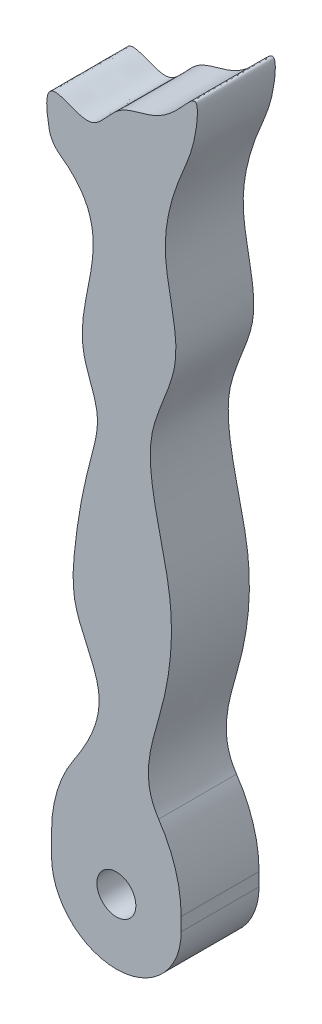
ISO-10303-21;
HEADER;
FILE_DESCRIPTION(('STEP AP214'),'2;1');
FILE_NAME('part.step','',(''),(''),'','','');
FILE_SCHEMA(('AUTOMOTIVE_DESIGN { 1 0 10303 214 1 1 1 1 }'));
ENDSEC;
DATA;
#1=APPLICATION_CONTEXT('core data for automotive mechanical design processes');
#2=APPLICATION_PROTOCOL_DEFINITION('international standard','automotive_design',2000,#1);
#3=PRODUCT_CONTEXT('',#1,'mechanical');
#4=PRODUCT('Part','Part','',(#3));
#5=PRODUCT_RELATED_PRODUCT_CATEGORY('part','',(#4));
#6=PRODUCT_DEFINITION_FORMATION('','',#4);
#7=PRODUCT_DEFINITION_CONTEXT('part definition',#1,'design');
#8=PRODUCT_DEFINITION('design','',#6,#7);
#9=PRODUCT_DEFINITION_SHAPE('','',#8);
#10=(LENGTH_UNIT() NAMED_UNIT(*) SI_UNIT(.MILLI.,.METRE.));
#11=(NAMED_UNIT(*) PLANE_ANGLE_UNIT() SI_UNIT($,.RADIAN.));
#12=(NAMED_UNIT(*) SI_UNIT($,.STERADIAN.) SOLID_ANGLE_UNIT());
#13=UNCERTAINTY_MEASURE_WITH_UNIT(LENGTH_MEASURE(1.E-05),#10,'distance_accuracy_value','');
#14=(GEOMETRIC_REPRESENTATION_CONTEXT(3) GLOBAL_UNCERTAINTY_ASSIGNED_CONTEXT((#13)) GLOBAL_UNIT_ASSIGNED_CONTEXT((#10,
#11,#12)) REPRESENTATION_CONTEXT('',''));
#15=CARTESIAN_POINT('',(0.,0.,0.));
#16=DIRECTION('',(0.,0.,1.));
#17=DIRECTION('',(1.,0.,0.));
#18=AXIS2_PLACEMENT_3D('',#15,#16,#17);
#19=CARTESIAN_POINT('',(0.,0.,6.));
#20=DIRECTION('',(0.,0.,1.));
#21=DIRECTION('',(1.,0.,0.));
#22=AXIS2_PLACEMENT_3D('',#19,#20,#21);
#23=PLANE('',#22);
#24=CARTESIAN_POINT('',(4.99,-4.99,6.));
#25=DIRECTION('',(0.,0.,1.));
#26=DIRECTION('',(1.,0.,0.));
#27=AXIS2_PLACEMENT_3D('',#24,#25,#26);
#28=CIRCLE('',#27,1.5);
#29=CARTESIAN_POINT('',(6.49,-4.99,6.));
#30=VERTEX_POINT('',#29);
#31=EDGE_CURVE('E144',#30,#30,#28,.T.);
#32=ORIENTED_EDGE('',*,*,#31,.F.);
#33=EDGE_LOOP('',(#32));
#34=FACE_BOUND('',#33,.T.);
#35=CARTESIAN_POINT('',(4.99,-4.99,6.));
#36=DIRECTION('',(0.,0.,1.));
#37=DIRECTION('',(1.,0.,0.));
#38=AXIS2_PLACEMENT_3D('',#35,#36,#37);
#39=CIRCLE('',#38,4.99);
#40=CARTESIAN_POINT('',(0.,-4.99,6.));
#41=VERTEX_POINT('',#40);
#42=CARTESIAN_POINT('',(9.98,-4.99,6.));
#43=VERTEX_POINT('',#42);
#44=EDGE_CURVE('E124',#41,#43,#39,.T.);
#45=ORIENTED_EDGE('',*,*,#44,.T.);
#46=DIRECTION('',(0.,-1.,0.));
#47=VECTOR('',#46,1.);
#48=CARTESIAN_POINT('',(9.98,0.,6.));
#49=LINE('',#48,#47);
#50=CARTESIAN_POINT('',(9.98,-3.97027980435303,6.));
#51=VERTEX_POINT('',#50);
#52=EDGE_CURVE('E128',#51,#43,#49,.T.);
#53=ORIENTED_EDGE('',*,*,#52,.F.);
#54=CARTESIAN_POINT('',(-0.0200000000000027,-3.97027980435303,6.));
#55=DIRECTION('',(0.,0.,1.));
#56=DIRECTION('',(1.,0.,0.));
#57=AXIS2_PLACEMENT_3D('',#54,#55,#56);
#58=CIRCLE('',#57,10.);
#59=CARTESIAN_POINT('',(8.24567465284087,1.65809674074271,6.));
#60=VERTEX_POINT('',#59);
#61=EDGE_CURVE('E230',#51,#60,#58,.T.);
#62=ORIENTED_EDGE('',*,*,#61,.T.);
#63=CARTESIAN_POINT('',(0.,42.5973535188665,6.));
#64=CARTESIAN_POINT('',(-1.37416776361586,48.5046458594314,6.));
#65=CARTESIAN_POINT('',(2.71808253226389,43.5726912842318,6.));
#66=CARTESIAN_POINT('',(4.82827520181116,47.7243203506309,6.));
#67=CARTESIAN_POINT('',(7.80778417163415,48.1508880987558,6.));
#68=CARTESIAN_POINT('',(9.4437713353899,49.2935827841813,6.));
#69=CARTESIAN_POINT('',(11.3623586634007,51.6284591964601,6.));
#70=CARTESIAN_POINT('',(11.1061791620638,47.8866974693389,6.));
#71=CARTESIAN_POINT('',(9.74359687436935,45.274160997908,6.));
#72=CARTESIAN_POINT('',(7.96002406904631,39.3631270866745,6.));
#73=CARTESIAN_POINT('',(10.7081509115366,33.0621930492346,6.));
#74=CARTESIAN_POINT('',(7.46997297742276,28.0469548101098,6.));
#75=CARTESIAN_POINT('',(7.68459606501081,22.5231191866999,6.));
#76=CARTESIAN_POINT('',(9.64502502926322,16.822172505094,6.));
#77=CARTESIAN_POINT('',(8.82164780003494,8.44030856162568,6.));
#78=CARTESIAN_POINT('',(6.05361406318936,2.65302671895344,6.));
#79=CARTESIAN_POINT('',(9.98,0.,6.));
#80=B_SPLINE_CURVE_WITH_KNOTS('',3,(#63,#64,#65,#66,#67,#68,#69,#70,#71,#72,#73,#74,#75,#76,#77,
#78,#79),.UNSPECIFIED.,.F.,.F.,(4,1,1,1,1,1,1,1,1,1,1,1,1,1,4),(0.,0.0816935318952506,
0.122819376835554,0.160760334375449,0.205378373312999,0.226065166843685,0.252136568138596,
0.308777768516648,0.391029694958459,0.500424408974528,0.587678436213662,0.631958895610175,
0.740886228331794,0.850025520120339,1.),.UNSPECIFIED.);
#81=CARTESIAN_POINT('',(-0.180841435382461,43.4408167100634,6.));
#82=VERTEX_POINT('',#81);
#83=EDGE_CURVE('E143',#82,#60,#80,.T.);
#84=ORIENTED_EDGE('',*,*,#83,.F.);
#85=CARTESIAN_POINT('',(1.78281542140347,43.8203582081866,6.));
#86=DIRECTION('',(0.,0.,1.));
#87=DIRECTION('',(1.,0.,0.));
#88=AXIS2_PLACEMENT_3D('',#85,#86,#87);
#89=CIRCLE('',#88,2.);
#90=CARTESIAN_POINT('',(0.627189000372463,42.1880201381119,6.));
#91=VERTEX_POINT('',#90);
#92=EDGE_CURVE('E67',#82,#91,#89,.T.);
#93=ORIENTED_EDGE('',*,*,#92,.T.);
#94=CARTESIAN_POINT('',(0.,42.5973535188665,6.));
#95=CARTESIAN_POINT('',(5.99917514769112,38.9776444105918,6.));
#96=CARTESIAN_POINT('',(0.377371098702882,32.7881709273886,6.));
#97=CARTESIAN_POINT('',(3.99264049027616,26.3880237657193,6.));
#98=CARTESIAN_POINT('',(2.58365344448983,21.7908235944806,6.));
#99=CARTESIAN_POINT('',(1.79791630641771,17.4144245417566,6.));
#100=CARTESIAN_POINT('',(1.45259306535408,12.0937314718818,6.));
#101=CARTESIAN_POINT('',(5.42598360781251,6.83613272854859,6.));
#102=CARTESIAN_POINT('',(1.50971209153614,2.01793829065264,6.));
#103=CARTESIAN_POINT('',(0.,0.,6.));
#104=B_SPLINE_CURVE_WITH_KNOTS('',3,(#94,#95,#96,#97,#98,#99,#100,#101,#102,#103),.UNSPECIFIED.,
.F.,.F.,(4,1,1,1,1,1,1,4),(0.,0.301224544779534,0.380755767888701,0.457986823242878,
0.608527536498481,0.686337501052727,0.807000810670003,1.),.UNSPECIFIED.);
#105=CARTESIAN_POINT('',(1.71356480303645,2.3441957016098,6.));
#106=VERTEX_POINT('',#105);
#107=EDGE_CURVE('E146',#91,#106,#104,.T.);
#108=ORIENTED_EDGE('',*,*,#107,.T.);
#109=CARTESIAN_POINT('',(10.,-3.25357097149507,6.));
#110=DIRECTION('',(0.,0.,1.));
#111=DIRECTION('',(1.,0.,0.));
#112=AXIS2_PLACEMENT_3D('',#109,#110,#111);
#113=CIRCLE('',#112,10.);
#114=CARTESIAN_POINT('',(0.,-3.25357097149507,6.));
#115=VERTEX_POINT('',#114);
#116=EDGE_CURVE('E228',#106,#115,#113,.T.);
#117=ORIENTED_EDGE('',*,*,#116,.T.);
#118=DIRECTION('',(0.,-1.,0.));
#119=VECTOR('',#118,1.);
#120=CARTESIAN_POINT('',(0.,0.,6.));
#121=LINE('',#120,#119);
#122=EDGE_CURVE('E131',#115,#41,#121,.T.);
#123=ORIENTED_EDGE('',*,*,#122,.T.);
#124=EDGE_LOOP('',(#45,#53,#62,#84,#93,#108,#117,#123));
#125=FACE_BOUND('',#124,.T.);
#126=ADVANCED_FACE('F59',(#34,#125),#23,.T.);
#127=CARTESIAN_POINT('',(0.,0.,0.));
#128=DIRECTION('',(0.,0.,1.));
#129=DIRECTION('',(1.,0.,0.));
#130=AXIS2_PLACEMENT_3D('',#127,#128,#129);
#131=PLANE('',#130);
#132=CARTESIAN_POINT('',(4.99,-4.99,0.));
#133=DIRECTION('',(0.,0.,1.));
#134=DIRECTION('',(1.,0.,0.));
#135=AXIS2_PLACEMENT_3D('',#132,#133,#134);
#136=CIRCLE('',#135,1.5);
#137=CARTESIAN_POINT('',(6.49,-4.99,0.));
#138=VERTEX_POINT('',#137);
#139=EDGE_CURVE('E250',#138,#138,#136,.T.);
#140=ORIENTED_EDGE('',*,*,#139,.T.);
#141=EDGE_LOOP('',(#140));
#142=FACE_BOUND('',#141,.T.);
#143=DIRECTION('',(0.,-1.,0.));
#144=VECTOR('',#143,1.);
#145=CARTESIAN_POINT('',(9.98,0.,0.));
#146=LINE('',#145,#144);
#147=CARTESIAN_POINT('',(9.98,-3.97027980435303,0.));
#148=VERTEX_POINT('',#147);
#149=CARTESIAN_POINT('',(9.98,-4.99,0.));
#150=VERTEX_POINT('',#149);
#151=EDGE_CURVE('E249',#148,#150,#146,.T.);
#152=ORIENTED_EDGE('',*,*,#151,.T.);
#153=CARTESIAN_POINT('',(4.99,-4.99,0.));
#154=DIRECTION('',(0.,0.,1.));
#155=DIRECTION('',(1.,0.,0.));
#156=AXIS2_PLACEMENT_3D('',#153,#154,#155);
#157=CIRCLE('',#156,4.99);
#158=CARTESIAN_POINT('',(0.,-4.99,0.));
#159=VERTEX_POINT('',#158);
#160=EDGE_CURVE('E12',#159,#150,#157,.T.);
#161=ORIENTED_EDGE('',*,*,#160,.F.);
#162=DIRECTION('',(0.,-1.,0.));
#163=VECTOR('',#162,1.);
#164=CARTESIAN_POINT('',(0.,0.,0.));
#165=LINE('',#164,#163);
#166=CARTESIAN_POINT('',(0.,-3.25357097149507,0.));
#167=VERTEX_POINT('',#166);
#168=EDGE_CURVE('E149',#167,#159,#165,.T.);
#169=ORIENTED_EDGE('',*,*,#168,.F.);
#170=CARTESIAN_POINT('',(10.,-3.25357097149507,0.));
#171=DIRECTION('',(0.,0.,1.));
#172=DIRECTION('',(1.,0.,0.));
#173=AXIS2_PLACEMENT_3D('',#170,#171,#172);
#174=CIRCLE('',#173,10.);
#175=CARTESIAN_POINT('',(1.71356480303645,2.3441957016098,0.));
#176=VERTEX_POINT('',#175);
#177=EDGE_CURVE('E223',#167,#176,#174,.F.);
#178=ORIENTED_EDGE('',*,*,#177,.T.);
#179=CARTESIAN_POINT('',(0.,42.5973535188665,0.));
#180=CARTESIAN_POINT('',(5.99917514769112,38.9776444105918,0.));
#181=CARTESIAN_POINT('',(0.377371098702882,32.7881709273886,0.));
#182=CARTESIAN_POINT('',(3.99264049027616,26.3880237657193,0.));
#183=CARTESIAN_POINT('',(2.58365344448983,21.7908235944806,0.));
#184=CARTESIAN_POINT('',(1.79791630641771,17.4144245417566,0.));
#185=CARTESIAN_POINT('',(1.45259306535408,12.0937314718818,0.));
#186=CARTESIAN_POINT('',(5.42598360781251,6.83613272854859,0.));
#187=CARTESIAN_POINT('',(1.50971209153614,2.01793829065264,0.));
#188=CARTESIAN_POINT('',(0.,0.,0.));
#189=B_SPLINE_CURVE_WITH_KNOTS('',3,(#179,#180,#181,#182,#183,#184,#185,#186,#187,#188),
.UNSPECIFIED.,.F.,.F.,(4,1,1,1,1,1,1,4),(0.,0.301224544779534,0.380755767888701,
0.457986823242878,0.608527536498481,0.686337501052727,0.807000810670003,1.),.UNSPECIFIED.);
#190=CARTESIAN_POINT('',(0.627189000372475,42.1880201381119,0.));
#191=VERTEX_POINT('',#190);
#192=EDGE_CURVE('E212',#191,#176,#189,.T.);
#193=ORIENTED_EDGE('',*,*,#192,.F.);
#194=CARTESIAN_POINT('',(1.78281542140347,43.8203582081866,0.));
#195=DIRECTION('',(0.,0.,1.));
#196=DIRECTION('',(1.,0.,0.));
#197=AXIS2_PLACEMENT_3D('',#194,#195,#196);
#198=CIRCLE('',#197,2.);
#199=CARTESIAN_POINT('',(-0.180841435382461,43.4408167100634,0.));
#200=VERTEX_POINT('',#199);
#201=EDGE_CURVE('E239',#191,#200,#198,.F.);
#202=ORIENTED_EDGE('',*,*,#201,.T.);
#203=CARTESIAN_POINT('',(0.,42.5973535188665,0.));
#204=CARTESIAN_POINT('',(-1.37416776361586,48.5046458594314,0.));
#205=CARTESIAN_POINT('',(2.71808253226389,43.5726912842318,0.));
#206=CARTESIAN_POINT('',(4.82827520181116,47.7243203506309,0.));
#207=CARTESIAN_POINT('',(7.80778417163415,48.1508880987558,0.));
#208=CARTESIAN_POINT('',(9.4437713353899,49.2935827841813,0.));
#209=CARTESIAN_POINT('',(11.3623586634007,51.6284591964601,0.));
#210=CARTESIAN_POINT('',(11.1061791620638,47.8866974693389,0.));
#211=CARTESIAN_POINT('',(9.74359687436935,45.274160997908,0.));
#212=CARTESIAN_POINT('',(7.96002406904631,39.3631270866745,0.));
#213=CARTESIAN_POINT('',(10.7081509115366,33.0621930492346,0.));
#214=CARTESIAN_POINT('',(7.46997297742276,28.0469548101098,0.));
#215=CARTESIAN_POINT('',(7.68459606501081,22.5231191866999,0.));
#216=CARTESIAN_POINT('',(9.64502502926322,16.822172505094,0.));
#217=CARTESIAN_POINT('',(8.82164780003494,8.44030856162568,0.));
#218=CARTESIAN_POINT('',(6.05361406318936,2.65302671895344,0.));
#219=CARTESIAN_POINT('',(9.98,0.,0.));
#220=B_SPLINE_CURVE_WITH_KNOTS('',3,(#203,#204,#205,#206,#207,#208,#209,#210,#211,#212,#213,
#214,#215,#216,#217,#218,#219),.UNSPECIFIED.,.F.,.F.,(4,1,1,1,1,1,1,1,1,1,1,1,1,1,4),(0.,
0.0816935318952506,0.122819376835554,0.160760334375449,0.205378373312999,0.226065166843685,
0.252136568138596,0.308777768516648,0.391029694958459,0.500424408974528,0.587678436213662,
0.631958895610175,0.740886228331794,0.850025520120339,1.),.UNSPECIFIED.);
#221=CARTESIAN_POINT('',(8.24567465284087,1.65809674074271,0.));
#222=VERTEX_POINT('',#221);
#223=EDGE_CURVE('E214',#200,#222,#220,.T.);
#224=ORIENTED_EDGE('',*,*,#223,.T.);
#225=CARTESIAN_POINT('',(-0.0200000000000027,-3.97027980435303,0.));
#226=DIRECTION('',(0.,0.,1.));
#227=DIRECTION('',(1.,0.,0.));
#228=AXIS2_PLACEMENT_3D('',#225,#226,#227);
#229=CIRCLE('',#228,10.);
#230=EDGE_CURVE('E225',#222,#148,#229,.F.);
#231=ORIENTED_EDGE('',*,*,#230,.T.);
#232=EDGE_LOOP('',(#152,#161,#169,#178,#193,#202,#224,#231));
#233=FACE_BOUND('',#232,.T.);
#234=ADVANCED_FACE('F172',(#142,#233),#131,.F.);
#235=CARTESIAN_POINT('',(9.98,0.,6.));
#236=DIRECTION('',(1.,0.,0.));
#237=DIRECTION('',(0.,0.,-1.));
#238=AXIS2_PLACEMENT_3D('',#235,#236,#237);
#239=PLANE('',#238);
#240=DIRECTION('',(0.,0.,1.));
#241=VECTOR('',#240,1.);
#242=CARTESIAN_POINT('',(9.98,-4.99,-4.));
#243=LINE('',#242,#241);
#244=EDGE_CURVE('E132',#150,#43,#243,.T.);
#245=ORIENTED_EDGE('',*,*,#244,.F.);
#246=ORIENTED_EDGE('',*,*,#151,.F.);
#247=DIRECTION('',(0.,0.,-1.));
#248=VECTOR('',#247,1.);
#249=CARTESIAN_POINT('',(9.98,-3.97027980435303,6.));
#250=LINE('',#249,#248);
#251=EDGE_CURVE('E142',#148,#51,#250,.F.);
#252=ORIENTED_EDGE('',*,*,#251,.T.);
#253=ORIENTED_EDGE('',*,*,#52,.T.);
#254=EDGE_LOOP('',(#245,#246,#252,#253));
#255=FACE_BOUND('',#254,.T.);
#256=ADVANCED_FACE('F140',(#255),#239,.T.);
#257=DIRECTION('',(0.,0.,-1.));
#258=VECTOR('',#257,1.);
#259=SURFACE_OF_LINEAR_EXTRUSION('',#80,#258);
#260=ORIENTED_EDGE('',*,*,#223,.F.);
#261=DIRECTION('',(0.,0.,-1.));
#262=VECTOR('',#261,1.);
#263=CARTESIAN_POINT('',(-0.180841435382463,43.4408167100634,0.));
#264=LINE('',#263,#262);
#265=EDGE_CURVE('E81',#200,#82,#264,.F.);
#266=ORIENTED_EDGE('',*,*,#265,.T.);
#267=ORIENTED_EDGE('',*,*,#83,.T.);
#268=DIRECTION('',(0.,0.,-1.));
#269=VECTOR('',#268,1.);
#270=CARTESIAN_POINT('',(8.24567465284087,1.65809674074271,6.));
#271=LINE('',#270,#269);
#272=EDGE_CURVE('E220',#60,#222,#271,.T.);
#273=ORIENTED_EDGE('',*,*,#272,.T.);
#274=EDGE_LOOP('',(#260,#266,#267,#273));
#275=FACE_BOUND('',#274,.T.);
#276=ADVANCED_FACE('F164',(#275),#259,.T.);
#277=DIRECTION('',(0.,0.,-1.));
#278=VECTOR('',#277,1.);
#279=SURFACE_OF_LINEAR_EXTRUSION('',#104,#278);
#280=ORIENTED_EDGE('',*,*,#107,.F.);
#281=DIRECTION('',(0.,0.,-1.));
#282=VECTOR('',#281,1.);
#283=CARTESIAN_POINT('',(0.627189000372479,42.1880201381119,6.));
#284=LINE('',#283,#282);
#285=EDGE_CURVE('E236',#91,#191,#284,.T.);
#286=ORIENTED_EDGE('',*,*,#285,.T.);
#287=ORIENTED_EDGE('',*,*,#192,.T.);
#288=DIRECTION('',(0.,0.,-1.));
#289=VECTOR('',#288,1.);
#290=CARTESIAN_POINT('',(1.71356480303645,2.3441957016098,0.));
#291=LINE('',#290,#289);
#292=EDGE_CURVE('E233',#176,#106,#291,.F.);
#293=ORIENTED_EDGE('',*,*,#292,.T.);
#294=EDGE_LOOP('',(#280,#286,#287,#293));
#295=FACE_BOUND('',#294,.T.);
#296=ADVANCED_FACE('F168',(#295),#279,.F.);
#297=CARTESIAN_POINT('',(4.99,-4.99,6.));
#298=DIRECTION('',(0.,0.,-1.));
#299=DIRECTION('',(-1.,0.,0.));
#300=AXIS2_PLACEMENT_3D('',#297,#298,#299);
#301=CYLINDRICAL_SURFACE('',#300,1.5);
#302=ORIENTED_EDGE('',*,*,#31,.T.);
#303=EDGE_LOOP('',(#302));
#304=FACE_BOUND('',#303,.T.);
#305=ORIENTED_EDGE('',*,*,#139,.F.);
#306=EDGE_LOOP('',(#305));
#307=FACE_BOUND('',#306,.T.);
#308=ADVANCED_FACE('F173',(#304,#307),#301,.F.);
#309=CARTESIAN_POINT('',(0.,0.,6.));
#310=DIRECTION('',(1.,0.,0.));
#311=DIRECTION('',(0.,1.,0.));
#312=AXIS2_PLACEMENT_3D('',#309,#310,#311);
#313=PLANE('',#312);
#314=ORIENTED_EDGE('',*,*,#168,.T.);
#315=DIRECTION('',(0.,0.,1.));
#316=VECTOR('',#315,1.);
#317=CARTESIAN_POINT('',(0.,-4.99,-4.));
#318=LINE('',#317,#316);
#319=EDGE_CURVE('E73',#159,#41,#318,.T.);
#320=ORIENTED_EDGE('',*,*,#319,.T.);
#321=ORIENTED_EDGE('',*,*,#122,.F.);
#322=DIRECTION('',(0.,0.,-1.));
#323=VECTOR('',#322,1.);
#324=CARTESIAN_POINT('',(0.,-3.25357097149507,6.));
#325=LINE('',#324,#323);
#326=EDGE_CURVE('E209',#115,#167,#325,.T.);
#327=ORIENTED_EDGE('',*,*,#326,.T.);
#328=EDGE_LOOP('',(#314,#320,#321,#327));
#329=FACE_BOUND('',#328,.T.);
#330=ADVANCED_FACE('F176',(#329),#313,.F.);
#331=CARTESIAN_POINT('',(-0.0200000000000027,-3.97027980435303,3.));
#332=DIRECTION('',(0.,0.,-1.));
#333=DIRECTION('',(-1.,0.,0.));
#334=AXIS2_PLACEMENT_3D('',#331,#332,#333);
#335=CYLINDRICAL_SURFACE('',#334,10.);
#336=ORIENTED_EDGE('',*,*,#61,.F.);
#337=ORIENTED_EDGE('',*,*,#251,.F.);
#338=ORIENTED_EDGE('',*,*,#230,.F.);
#339=ORIENTED_EDGE('',*,*,#272,.F.);
#340=EDGE_LOOP('',(#336,#337,#338,#339));
#341=FACE_BOUND('',#340,.T.);
#342=ADVANCED_FACE('F178',(#341),#335,.T.);
#343=CARTESIAN_POINT('',(10.,-3.25357097149507,3.));
#344=DIRECTION('',(0.,0.,-1.));
#345=DIRECTION('',(-1.,0.,0.));
#346=AXIS2_PLACEMENT_3D('',#343,#344,#345);
#347=CYLINDRICAL_SURFACE('',#346,10.);
#348=ORIENTED_EDGE('',*,*,#116,.F.);
#349=ORIENTED_EDGE('',*,*,#292,.F.);
#350=ORIENTED_EDGE('',*,*,#177,.F.);
#351=ORIENTED_EDGE('',*,*,#326,.F.);
#352=EDGE_LOOP('',(#348,#349,#350,#351));
#353=FACE_BOUND('',#352,.T.);
#354=ADVANCED_FACE('F180',(#353),#347,.T.);
#355=CARTESIAN_POINT('',(1.78281542140347,43.8203582081866,3.));
#356=DIRECTION('',(0.,0.,-1.));
#357=DIRECTION('',(-1.,0.,0.));
#358=AXIS2_PLACEMENT_3D('',#355,#356,#357);
#359=CYLINDRICAL_SURFACE('',#358,2.);
#360=ORIENTED_EDGE('',*,*,#92,.F.);
#361=ORIENTED_EDGE('',*,*,#265,.F.);
#362=ORIENTED_EDGE('',*,*,#201,.F.);
#363=ORIENTED_EDGE('',*,*,#285,.F.);
#364=EDGE_LOOP('',(#360,#361,#362,#363));
#365=FACE_BOUND('',#364,.T.);
#366=ADVANCED_FACE('F61',(#365),#359,.T.);
#367=CARTESIAN_POINT('',(4.99,-4.99,-4.));
#368=DIRECTION('',(0.,0.,1.));
#369=DIRECTION('',(1.,0.,0.));
#370=AXIS2_PLACEMENT_3D('',#367,#368,#369);
#371=CYLINDRICAL_SURFACE('',#370,4.99);
#372=ORIENTED_EDGE('',*,*,#160,.T.);
#373=ORIENTED_EDGE('',*,*,#244,.T.);
#374=ORIENTED_EDGE('',*,*,#44,.F.);
#375=ORIENTED_EDGE('',*,*,#319,.F.);
#376=EDGE_LOOP('',(#372,#373,#374,#375));
#377=FACE_BOUND('',#376,.T.);
#378=ADVANCED_FACE('F135',(#377),#371,.T.);
#379=CLOSED_SHELL('',(#126,#234,#256,#276,#296,#308,#330,#342,#354,#366,#378));
#380=MANIFOLD_SOLID_BREP('B2',#379);
#381=ADVANCED_BREP_SHAPE_REPRESENTATION('',(#18,#380),#14);
#382=SHAPE_DEFINITION_REPRESENTATION(#9,#381);
ENDSEC;
END-ISO-10303-21;
